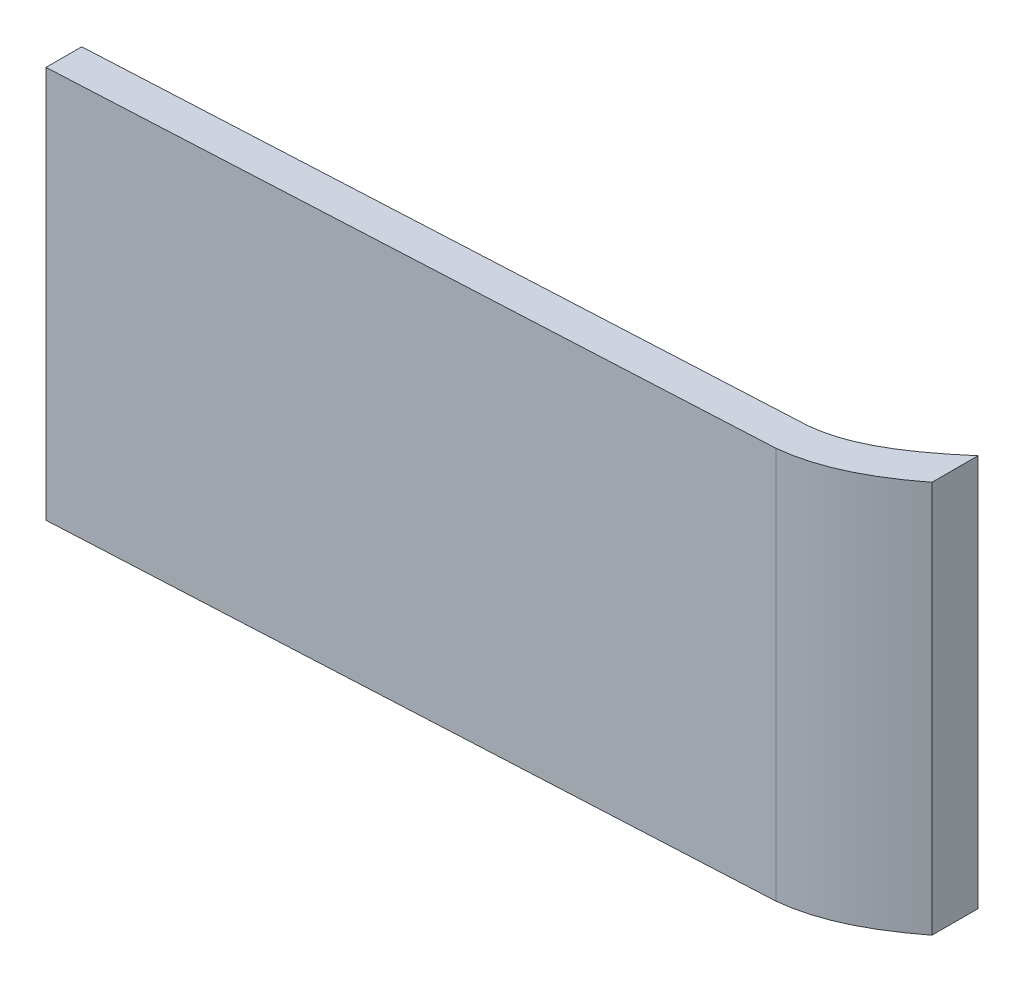
ISO-10303-21;
HEADER;
FILE_DESCRIPTION(('STEP AP214'),'2;1');
FILE_NAME('part.step','',(''),(''),'','','');
FILE_SCHEMA(('AUTOMOTIVE_DESIGN { 1 0 10303 214 1 1 1 1 }'));
ENDSEC;
DATA;
#1=APPLICATION_CONTEXT('core data for automotive mechanical design processes');
#2=APPLICATION_PROTOCOL_DEFINITION('international standard','automotive_design',2000,#1);
#3=PRODUCT_CONTEXT('',#1,'mechanical');
#4=PRODUCT('Part','Part','',(#3));
#5=PRODUCT_RELATED_PRODUCT_CATEGORY('part','',(#4));
#6=PRODUCT_DEFINITION_FORMATION('','',#4);
#7=PRODUCT_DEFINITION_CONTEXT('part definition',#1,'design');
#8=PRODUCT_DEFINITION('design','',#6,#7);
#9=PRODUCT_DEFINITION_SHAPE('','',#8);
#10=(LENGTH_UNIT() NAMED_UNIT(*) SI_UNIT(.MILLI.,.METRE.));
#11=(NAMED_UNIT(*) PLANE_ANGLE_UNIT() SI_UNIT($,.RADIAN.));
#12=(NAMED_UNIT(*) SI_UNIT($,.STERADIAN.) SOLID_ANGLE_UNIT());
#13=UNCERTAINTY_MEASURE_WITH_UNIT(LENGTH_MEASURE(1.E-05),#10,'distance_accuracy_value','');
#14=(GEOMETRIC_REPRESENTATION_CONTEXT(3) GLOBAL_UNCERTAINTY_ASSIGNED_CONTEXT((#13)) GLOBAL_UNIT_ASSIGNED_CONTEXT((#10,
#11,#12)) REPRESENTATION_CONTEXT('',''));
#15=CARTESIAN_POINT('',(0.,0.,0.));
#16=DIRECTION('',(0.,0.,1.));
#17=DIRECTION('',(1.,0.,0.));
#18=AXIS2_PLACEMENT_3D('',#15,#16,#17);
#19=CARTESIAN_POINT('',(15.2026066350711,-55.02,-53.3815975655058));
#20=DIRECTION('',(-1.,0.,0.));
#21=DIRECTION('',(0.,0.,1.));
#22=AXIS2_PLACEMENT_3D('',#19,#20,#21);
#23=PLANE('',#22);
#24=DIRECTION('',(0.,-1.,0.));
#25=VECTOR('',#24,1.);
#26=CARTESIAN_POINT('',(15.2026066350711,-55.,62.2678534896764));
#27=LINE('',#26,#25);
#28=CARTESIAN_POINT('',(15.2026066350711,0.,62.2678534896764));
#29=VERTEX_POINT('',#28);
#30=CARTESIAN_POINT('',(15.2026066350711,-55.,62.2678534896764));
#31=VERTEX_POINT('',#30);
#32=EDGE_CURVE('E329',#29,#31,#27,.T.);
#33=ORIENTED_EDGE('',*,*,#32,.F.);
#34=DIRECTION('',(0.,0.,-1.));
#35=VECTOR('',#34,1.);
#36=CARTESIAN_POINT('',(15.2026066350711,0.,32.5431279620853));
#37=LINE('',#36,#35);
#38=CARTESIAN_POINT('',(15.2026066350711,0.,57.261470947906));
#39=VERTEX_POINT('',#38);
#40=EDGE_CURVE('E322',#29,#39,#37,.T.);
#41=ORIENTED_EDGE('',*,*,#40,.T.);
#42=DIRECTION('',(0.,-1.,0.));
#43=VECTOR('',#42,1.);
#44=CARTESIAN_POINT('',(15.2026066350711,-55.,57.261470947906));
#45=LINE('',#44,#43);
#46=CARTESIAN_POINT('',(15.2026066350711,-25.,57.261470947906));
#47=VERTEX_POINT('',#46);
#48=EDGE_CURVE('E325',#39,#47,#45,.T.);
#49=ORIENTED_EDGE('',*,*,#48,.T.);
#50=DIRECTION('',(0.,0.,-1.));
#51=VECTOR('',#50,1.);
#52=CARTESIAN_POINT('',(15.2026066350711,-25.,54.7700862993215));
#53=LINE('',#52,#51);
#54=CARTESIAN_POINT('',(15.2026066350711,-25.,54.2576414228439));
#55=VERTEX_POINT('',#54);
#56=EDGE_CURVE('E141',#47,#55,#53,.T.);
#57=ORIENTED_EDGE('',*,*,#56,.T.);
#58=DIRECTION('',(0.,1.,0.));
#59=VECTOR('',#58,1.);
#60=CARTESIAN_POINT('',(15.2026066350711,0.,54.2576414228439));
#61=LINE('',#60,#59);
#62=CARTESIAN_POINT('',(15.2026066350711,-27.,54.2576414228439));
#63=VERTEX_POINT('',#62);
#64=EDGE_CURVE('E152',#63,#55,#61,.T.);
#65=ORIENTED_EDGE('',*,*,#64,.F.);
#66=DIRECTION('',(0.,0.,-1.));
#67=VECTOR('',#66,1.);
#68=CARTESIAN_POINT('',(15.2026066350711,-27.,54.7700862993215));
#69=LINE('',#68,#67);
#70=CARTESIAN_POINT('',(15.2026066350711,-27.,57.261470947906));
#71=VERTEX_POINT('',#70);
#72=EDGE_CURVE('E337',#71,#63,#69,.T.);
#73=ORIENTED_EDGE('',*,*,#72,.F.);
#74=CARTESIAN_POINT('',(15.2026066350711,-53.,57.2614709479061));
#75=VERTEX_POINT('',#74);
#76=EDGE_CURVE('E140',#71,#75,#45,.T.);
#77=ORIENTED_EDGE('',*,*,#76,.T.);
#78=DIRECTION('',(0.,0.,-1.));
#79=VECTOR('',#78,1.);
#80=CARTESIAN_POINT('',(15.2026066350711,-53.,54.7700862993215));
#81=LINE('',#80,#79);
#82=CARTESIAN_POINT('',(15.2026066350711,-53.,54.2576414228439));
#83=VERTEX_POINT('',#82);
#84=EDGE_CURVE('E130',#75,#83,#81,.T.);
#85=ORIENTED_EDGE('',*,*,#84,.T.);
#86=DIRECTION('',(0.,-1.,0.));
#87=VECTOR('',#86,1.);
#88=CARTESIAN_POINT('',(15.2026066350711,0.,54.2576414228439));
#89=LINE('',#88,#87);
#90=CARTESIAN_POINT('',(15.2026066350711,-55.,54.2576414228439));
#91=VERTEX_POINT('',#90);
#92=EDGE_CURVE('E138',#83,#91,#89,.T.);
#93=ORIENTED_EDGE('',*,*,#92,.T.);
#94=DIRECTION('',(0.,0.,-1.));
#95=VECTOR('',#94,1.);
#96=CARTESIAN_POINT('',(15.2026066350711,-55.,32.5431279620853));
#97=LINE('',#96,#95);
#98=EDGE_CURVE('E335',#31,#91,#97,.T.);
#99=ORIENTED_EDGE('',*,*,#98,.F.);
#100=EDGE_LOOP('',(#33,#41,#49,#57,#65,#73,#77,#85,#93,#99));
#101=FACE_BOUND('',#100,.T.);
#102=ADVANCED_FACE('F35',(#101),#23,.T.);
#103=CARTESIAN_POINT('',(112.637979465165,-55.,57.3431279620853));
#104=CARTESIAN_POINT('',(125.082628435847,-55.,56.0277246140255));
#105=CARTESIAN_POINT('',(133.287763268237,-55.,44.6620146683521));
#106=CARTESIAN_POINT('',(142.702606635071,-55.,37.9431279620853));
#107=B_SPLINE_CURVE_WITH_KNOTS('',3,(#103,#104,#105,#106),.UNSPECIFIED.,.F.,.F.,(4,4),(0.,1.),.UNSPECIFIED.);
#108=DIRECTION('',(0.,1.,0.));
#109=VECTOR('',#108,1.);
#110=SURFACE_OF_LINEAR_EXTRUSION('',#107,#109);
#111=DIRECTION('',(0.,1.,0.));
#112=VECTOR('',#111,1.);
#113=CARTESIAN_POINT('',(127.702606635071,-55.,50.5386095784652));
#114=LINE('',#113,#112);
#115=CARTESIAN_POINT('',(127.702606630983,0.,50.5386095816137));
#116=VERTEX_POINT('',#115);
#117=CARTESIAN_POINT('',(127.702606635071,-55.,50.5386095784652));
#118=VERTEX_POINT('',#117);
#119=EDGE_CURVE('E179',#116,#118,#114,.F.);
#120=ORIENTED_EDGE('',*,*,#119,.F.);
#121=CARTESIAN_POINT('',(112.637979465165,0.,57.3431279620853));
#122=CARTESIAN_POINT('',(125.082628435847,0.,56.0277246140255));
#123=CARTESIAN_POINT('',(133.287763268237,0.,44.6620146683521));
#124=CARTESIAN_POINT('',(142.702606635071,0.,37.9431279620853));
#125=B_SPLINE_CURVE_WITH_KNOTS('',3,(#121,#122,#123,#124),.UNSPECIFIED.,.F.,.F.,(4,4),(0.,1.),.UNSPECIFIED.);
#126=CARTESIAN_POINT('',(112.637979465165,0.,57.3431279620853));
#127=VERTEX_POINT('',#126);
#128=EDGE_CURVE('E157',#127,#116,#125,.T.);
#129=ORIENTED_EDGE('',*,*,#128,.F.);
#130=DIRECTION('',(0.,1.,0.));
#131=VECTOR('',#130,1.);
#132=CARTESIAN_POINT('',(112.637979465165,-55.,57.3431279620853));
#133=LINE('',#132,#131);
#134=CARTESIAN_POINT('',(112.637979465165,-55.,57.3431279620853));
#135=VERTEX_POINT('',#134);
#136=EDGE_CURVE('E311',#135,#127,#133,.T.);
#137=ORIENTED_EDGE('',*,*,#136,.F.);
#138=EDGE_CURVE('E161',#135,#118,#107,.T.);
#139=ORIENTED_EDGE('',*,*,#138,.T.);
#140=EDGE_LOOP('',(#120,#129,#137,#139));
#141=FACE_BOUND('',#140,.T.);
#142=ADVANCED_FACE('F227',(#141),#110,.T.);
#143=CARTESIAN_POINT('',(-77.2973933649289,-55.,66.9431279620853));
#144=DIRECTION('',(0.0504790708541747,0.,0.998725119042121));
#145=DIRECTION('',(0.998725119042121,0.,-0.0504790708541747));
#146=AXIS2_PLACEMENT_3D('',#143,#144,#145);
#147=PLANE('',#146);
#148=DIRECTION('',(0.998725119042121,0.,-0.0504790708541747));
#149=VECTOR('',#148,1.);
#150=CARTESIAN_POINT('',(-77.2973933649289,0.,66.9431279620853));
#151=LINE('',#150,#149);
#152=EDGE_CURVE('E155',#29,#127,#151,.T.);
#153=ORIENTED_EDGE('',*,*,#152,.F.);
#154=ORIENTED_EDGE('',*,*,#32,.T.);
#155=DIRECTION('',(0.998725119042121,0.,-0.0504790708541747));
#156=VECTOR('',#155,1.);
#157=CARTESIAN_POINT('',(-77.2973933649289,-55.,66.9431279620853));
#158=LINE('',#157,#156);
#159=EDGE_CURVE('E159',#31,#135,#158,.T.);
#160=ORIENTED_EDGE('',*,*,#159,.T.);
#161=ORIENTED_EDGE('',*,*,#136,.T.);
#162=EDGE_LOOP('',(#153,#154,#160,#161));
#163=FACE_BOUND('',#162,.T.);
#164=ADVANCED_FACE('F297',(#163),#147,.T.);
#165=CARTESIAN_POINT('',(-77.2198387862858,-55.,61.9328255398636));
#166=DIRECTION('',(0.0504790708541748,0.,0.998725119042121));
#167=DIRECTION('',(0.998725119042121,0.,-0.0504790708541748));
#168=AXIS2_PLACEMENT_3D('',#165,#166,#167);
#169=PLANE('',#168);
#170=ORIENTED_EDGE('',*,*,#48,.F.);
#171=DIRECTION('',(0.998725119042121,0.,-0.0504790708541748));
#172=VECTOR('',#171,1.);
#173=CARTESIAN_POINT('',(-77.2198387862858,0.,61.9328255398636));
#174=LINE('',#173,#172);
#175=CARTESIAN_POINT('',(112.240105598559,0.,52.356855361199));
#176=VERTEX_POINT('',#175);
#177=EDGE_CURVE('E154',#39,#176,#174,.T.);
#178=ORIENTED_EDGE('',*,*,#177,.T.);
#179=DIRECTION('',(0.,1.,0.));
#180=VECTOR('',#179,1.);
#181=CARTESIAN_POINT('',(112.240105598559,-55.,52.356855361199));
#182=LINE('',#181,#180);
#183=CARTESIAN_POINT('',(112.240105598559,-55.,52.356855361199));
#184=VERTEX_POINT('',#183);
#185=EDGE_CURVE('E158',#184,#176,#182,.T.);
#186=ORIENTED_EDGE('',*,*,#185,.F.);
#187=DIRECTION('',(0.998725119042121,0.,-0.0504790708541748));
#188=VECTOR('',#187,1.);
#189=CARTESIAN_POINT('',(-77.2198387862858,-55.,61.9328255398636));
#190=LINE('',#189,#188);
#191=CARTESIAN_POINT('',(25.1898578254923,-55.,56.7566802393643));
#192=VERTEX_POINT('',#191);
#193=EDGE_CURVE('E176',#192,#184,#190,.T.);
#194=ORIENTED_EDGE('',*,*,#193,.F.);
#195=DIRECTION('',(0.,-1.,0.));
#196=VECTOR('',#195,1.);
#197=CARTESIAN_POINT('',(25.1898578254923,-53.,56.7566802393643));
#198=LINE('',#197,#196);
#199=CARTESIAN_POINT('',(25.1898578254923,-53.,56.7566802393643));
#200=VERTEX_POINT('',#199);
#201=EDGE_CURVE('E171',#200,#192,#198,.T.);
#202=ORIENTED_EDGE('',*,*,#201,.F.);
#203=DIRECTION('',(0.998725119042121,0.,-0.0504790708541747));
#204=VECTOR('',#203,1.);
#205=CARTESIAN_POINT('',(5.21535544464991,-53.,57.7662616564478));
#206=LINE('',#205,#204);
#207=EDGE_CURVE('E169',#75,#200,#206,.T.);
#208=ORIENTED_EDGE('',*,*,#207,.F.);
#209=ORIENTED_EDGE('',*,*,#76,.F.);
#210=DIRECTION('',(0.998725119042121,0.,-0.0504790708541748));
#211=VECTOR('',#210,1.);
#212=CARTESIAN_POINT('',(-77.2198387862858,-27.,61.9328255398636));
#213=LINE('',#212,#211);
#214=CARTESIAN_POINT('',(25.1898578254923,-27.,56.7566802393643));
#215=VERTEX_POINT('',#214);
#216=EDGE_CURVE('E151',#71,#215,#213,.T.);
#217=ORIENTED_EDGE('',*,*,#216,.T.);
#218=DIRECTION('',(0.,1.,0.));
#219=VECTOR('',#218,1.);
#220=CARTESIAN_POINT('',(25.1898578254923,-27.,56.7566802393643));
#221=LINE('',#220,#219);
#222=CARTESIAN_POINT('',(25.1898578254923,-25.,56.7566802393643));
#223=VERTEX_POINT('',#222);
#224=EDGE_CURVE('E168',#215,#223,#221,.T.);
#225=ORIENTED_EDGE('',*,*,#224,.T.);
#226=DIRECTION('',(0.998725119042121,0.,-0.0504790708541748));
#227=VECTOR('',#226,1.);
#228=CARTESIAN_POINT('',(-77.2198387862858,-25.,61.9328255398636));
#229=LINE('',#228,#227);
#230=EDGE_CURVE('E149',#47,#223,#229,.T.);
#231=ORIENTED_EDGE('',*,*,#230,.F.);
#232=EDGE_LOOP('',(#170,#178,#186,#194,#202,#208,#209,#217,#225,#231));
#233=FACE_BOUND('',#232,.T.);
#234=ADVANCED_FACE('F275',(#233),#169,.F.);
#235=CARTESIAN_POINT('',(-115.897393364929,-55.,32.5431279620853));
#236=DIRECTION('',(0.,-1.,0.));
#237=DIRECTION('',(0.,0.,-1.));
#238=AXIS2_PLACEMENT_3D('',#235,#236,#237);
#239=PLANE('',#238);
#240=ORIENTED_EDGE('',*,*,#159,.F.);
#241=ORIENTED_EDGE('',*,*,#98,.T.);
#242=DIRECTION('',(0.998725119042121,0.,-0.0504790708541747));
#243=VECTOR('',#242,1.);
#244=CARTESIAN_POINT('',(5.06391823208739,-55.,54.7700862993215));
#245=LINE('',#244,#243);
#246=CARTESIAN_POINT('',(25.0384206129298,-55.,53.760504882238));
#247=VERTEX_POINT('',#246);
#248=EDGE_CURVE('E144',#91,#247,#245,.T.);
#249=ORIENTED_EDGE('',*,*,#248,.T.);
#250=DIRECTION('',(0.0504790708541748,0.,0.998725119042121));
#251=VECTOR('',#250,1.);
#252=CARTESIAN_POINT('',(25.0384206129298,-55.,53.760504882238));
#253=LINE('',#252,#251);
#254=EDGE_CURVE('E45',#247,#192,#253,.T.);
#255=ORIENTED_EDGE('',*,*,#254,.T.);
#256=ORIENTED_EDGE('',*,*,#193,.T.);
#257=CARTESIAN_POINT('',(127.702606635083,-55.,44.0854997038493));
#258=CARTESIAN_POINT('',(127.648334728722,-55.,44.1319265625261));
#259=CARTESIAN_POINT('',(127.594021710344,-55.,44.1783019917653));
#260=CARTESIAN_POINT('',(126.421126605525,-55.,45.177833585712));
#261=CARTESIAN_POINT('',(125.285242411055,-55.,46.1072897473864));
#262=CARTESIAN_POINT('',(122.940710015654,-55.,47.8665531930068));
#263=CARTESIAN_POINT('',(121.732436004902,-55.,48.6968729230532));
#264=CARTESIAN_POINT('',(119.826422425126,-55.,49.8141656456051));
#265=CARTESIAN_POINT('',(119.174145436909,-55.,50.1652416105287));
#266=CARTESIAN_POINT('',(117.853343767534,-55.,50.8014316555564));
#267=CARTESIAN_POINT('',(117.182437856964,-55.,51.0880355779591));
#268=CARTESIAN_POINT('',(115.132971642683,-55.,51.8376862995458));
#269=CARTESIAN_POINT('',(113.717382254336,-55.,52.189730891389));
#270=CARTESIAN_POINT('',(112.240105598559,-55.,52.356855361199));
#271=B_SPLINE_CURVE_WITH_KNOTS('',3,(#257,#258,#259,#260,#261,#262,#263,#264,#265,#266,#267,
#268,#269,#270),.UNSPECIFIED.,.F.,.F.,(4,2,2,2,2,2,4),(0.,0.00607443775296701,0.131074437752967,
0.256074437752967,0.318574437752967,0.381074437752967,0.506074437752967),.UNSPECIFIED.);
#272=CARTESIAN_POINT('',(127.702606635083,-55.,44.0854997038494));
#273=VERTEX_POINT('',#272);
#274=EDGE_CURVE('E178',#184,#273,#271,.F.);
#275=ORIENTED_EDGE('',*,*,#274,.T.);
#276=DIRECTION('',(0.,0.,-1.));
#277=VECTOR('',#276,1.);
#278=CARTESIAN_POINT('',(127.702606635071,-55.,32.5431279620852));
#279=LINE('',#278,#277);
#280=EDGE_CURVE('E182',#118,#273,#279,.T.);
#281=ORIENTED_EDGE('',*,*,#280,.F.);
#282=ORIENTED_EDGE('',*,*,#138,.F.);
#283=EDGE_LOOP('',(#240,#241,#249,#255,#256,#275,#281,#282));
#284=FACE_BOUND('',#283,.T.);
#285=ADVANCED_FACE('F252',(#284),#239,.T.);
#286=CARTESIAN_POINT('',(25.0384206129298,-53.,53.760504882238));
#287=DIRECTION('',(-0.998725119042121,0.,0.0504790708541748));
#288=DIRECTION('',(0.0504790708541748,0.,0.998725119042121));
#289=AXIS2_PLACEMENT_3D('',#286,#287,#288);
#290=PLANE('',#289);
#291=ORIENTED_EDGE('',*,*,#201,.T.);
#292=ORIENTED_EDGE('',*,*,#254,.F.);
#293=DIRECTION('',(0.,-1.,0.));
#294=VECTOR('',#293,1.);
#295=CARTESIAN_POINT('',(25.0384206129298,-53.,53.760504882238));
#296=LINE('',#295,#294);
#297=CARTESIAN_POINT('',(25.0384206129298,-53.,53.760504882238));
#298=VERTEX_POINT('',#297);
#299=EDGE_CURVE('E132',#298,#247,#296,.T.);
#300=ORIENTED_EDGE('',*,*,#299,.F.);
#301=DIRECTION('',(0.0504790708541748,0.,0.998725119042121));
#302=VECTOR('',#301,1.);
#303=CARTESIAN_POINT('',(25.0384206129298,-53.,53.760504882238));
#304=LINE('',#303,#302);
#305=EDGE_CURVE('E11',#298,#200,#304,.T.);
#306=ORIENTED_EDGE('',*,*,#305,.T.);
#307=EDGE_LOOP('',(#291,#292,#300,#306));
#308=FACE_BOUND('',#307,.T.);
#309=ADVANCED_FACE('F274',(#308),#290,.F.);
#310=CARTESIAN_POINT('',(5.06391823208739,-53.,54.7700862993215));
#311=DIRECTION('',(0.,-1.,0.));
#312=DIRECTION('',(0.,0.,-1.));
#313=AXIS2_PLACEMENT_3D('',#310,#311,#312);
#314=PLANE('',#313);
#315=ORIENTED_EDGE('',*,*,#84,.F.);
#316=ORIENTED_EDGE('',*,*,#207,.T.);
#317=ORIENTED_EDGE('',*,*,#305,.F.);
#318=DIRECTION('',(0.998725119042121,0.,-0.0504790708541747));
#319=VECTOR('',#318,1.);
#320=CARTESIAN_POINT('',(5.06391823208739,-53.,54.7700862993215));
#321=LINE('',#320,#319);
#322=EDGE_CURVE('E53',#83,#298,#321,.T.);
#323=ORIENTED_EDGE('',*,*,#322,.F.);
#324=EDGE_LOOP('',(#315,#316,#317,#323));
#325=FACE_BOUND('',#324,.T.);
#326=ADVANCED_FACE('F128',(#325),#314,.F.);
#327=CARTESIAN_POINT('',(2.77412190406091,0.,54.88582063791));
#328=DIRECTION('',(0.0504790708541748,0.,0.998725119042121));
#329=DIRECTION('',(0.998725119042121,0.,-0.0504790708541748));
#330=AXIS2_PLACEMENT_3D('',#327,#328,#329);
#331=PLANE('',#330);
#332=ORIENTED_EDGE('',*,*,#92,.F.);
#333=ORIENTED_EDGE('',*,*,#322,.T.);
#334=ORIENTED_EDGE('',*,*,#299,.T.);
#335=ORIENTED_EDGE('',*,*,#248,.F.);
#336=EDGE_LOOP('',(#332,#333,#334,#335));
#337=FACE_BOUND('',#336,.T.);
#338=ADVANCED_FACE('F143',(#337),#331,.F.);
#339=CARTESIAN_POINT('',(25.0384206129298,-27.,53.760504882238));
#340=DIRECTION('',(0.998725119042121,0.,-0.0504790708541748));
#341=DIRECTION('',(-0.0504790708541748,0.,-0.998725119042121));
#342=AXIS2_PLACEMENT_3D('',#339,#340,#341);
#343=PLANE('',#342);
#344=ORIENTED_EDGE('',*,*,#224,.F.);
#345=DIRECTION('',(0.0504790708541748,0.,0.998725119042121));
#346=VECTOR('',#345,1.);
#347=CARTESIAN_POINT('',(25.0384206129298,-27.,53.760504882238));
#348=LINE('',#347,#346);
#349=CARTESIAN_POINT('',(25.0384206129298,-27.,53.760504882238));
#350=VERTEX_POINT('',#349);
#351=EDGE_CURVE('E165',#350,#215,#348,.T.);
#352=ORIENTED_EDGE('',*,*,#351,.F.);
#353=DIRECTION('',(0.,1.,0.));
#354=VECTOR('',#353,1.);
#355=CARTESIAN_POINT('',(25.0384206129298,-27.,53.760504882238));
#356=LINE('',#355,#354);
#357=CARTESIAN_POINT('',(25.0384206129298,-25.,53.760504882238));
#358=VERTEX_POINT('',#357);
#359=EDGE_CURVE('E164',#350,#358,#356,.T.);
#360=ORIENTED_EDGE('',*,*,#359,.T.);
#361=DIRECTION('',(0.0504790708541748,0.,0.998725119042121));
#362=VECTOR('',#361,1.);
#363=CARTESIAN_POINT('',(25.0384206129298,-25.,53.760504882238));
#364=LINE('',#363,#362);
#365=EDGE_CURVE('E195',#358,#223,#364,.T.);
#366=ORIENTED_EDGE('',*,*,#365,.T.);
#367=EDGE_LOOP('',(#344,#352,#360,#366));
#368=FACE_BOUND('',#367,.T.);
#369=ADVANCED_FACE('F280',(#368),#343,.T.);
#370=CARTESIAN_POINT('',(5.06391823208738,-25.,54.7700862993215));
#371=DIRECTION('',(0.,-1.,0.));
#372=DIRECTION('',(0.,0.,-1.));
#373=AXIS2_PLACEMENT_3D('',#370,#371,#372);
#374=PLANE('',#373);
#375=ORIENTED_EDGE('',*,*,#56,.F.);
#376=ORIENTED_EDGE('',*,*,#230,.T.);
#377=ORIENTED_EDGE('',*,*,#365,.F.);
#378=DIRECTION('',(0.998725119042121,0.,-0.0504790708541747));
#379=VECTOR('',#378,1.);
#380=CARTESIAN_POINT('',(5.06391823208738,-25.,54.7700862993215));
#381=LINE('',#380,#379);
#382=EDGE_CURVE('E166',#55,#358,#381,.T.);
#383=ORIENTED_EDGE('',*,*,#382,.F.);
#384=EDGE_LOOP('',(#375,#376,#377,#383));
#385=FACE_BOUND('',#384,.T.);
#386=ADVANCED_FACE('F285',(#385),#374,.F.);
#387=CARTESIAN_POINT('',(5.06391823208739,-27.,54.7700862993215));
#388=DIRECTION('',(0.,-1.,0.));
#389=DIRECTION('',(0.,0.,-1.));
#390=AXIS2_PLACEMENT_3D('',#387,#388,#389);
#391=PLANE('',#390);
#392=ORIENTED_EDGE('',*,*,#216,.F.);
#393=ORIENTED_EDGE('',*,*,#72,.T.);
#394=DIRECTION('',(0.998725119042121,0.,-0.0504790708541747));
#395=VECTOR('',#394,1.);
#396=CARTESIAN_POINT('',(5.06391823208739,-27.,54.7700862993215));
#397=LINE('',#396,#395);
#398=EDGE_CURVE('E162',#63,#350,#397,.T.);
#399=ORIENTED_EDGE('',*,*,#398,.T.);
#400=ORIENTED_EDGE('',*,*,#351,.T.);
#401=EDGE_LOOP('',(#392,#393,#399,#400));
#402=FACE_BOUND('',#401,.T.);
#403=ADVANCED_FACE('F287',(#402),#391,.T.);
#404=CARTESIAN_POINT('',(2.7741219040609,0.,54.88582063791));
#405=DIRECTION('',(-0.0504790708541747,0.,-0.998725119042121));
#406=DIRECTION('',(-0.998725119042121,0.,0.0504790708541747));
#407=AXIS2_PLACEMENT_3D('',#404,#405,#406);
#408=PLANE('',#407);
#409=ORIENTED_EDGE('',*,*,#398,.F.);
#410=ORIENTED_EDGE('',*,*,#64,.T.);
#411=ORIENTED_EDGE('',*,*,#382,.T.);
#412=ORIENTED_EDGE('',*,*,#359,.F.);
#413=EDGE_LOOP('',(#409,#410,#411,#412));
#414=FACE_BOUND('',#413,.T.);
#415=ADVANCED_FACE('F37',(#414),#408,.T.);
#416=CARTESIAN_POINT('',(-115.897393364929,0.,32.5431279620853));
#417=DIRECTION('',(0.,-1.,0.));
#418=DIRECTION('',(0.,0.,-1.));
#419=AXIS2_PLACEMENT_3D('',#416,#417,#418);
#420=PLANE('',#419);
#421=ORIENTED_EDGE('',*,*,#40,.F.);
#422=ORIENTED_EDGE('',*,*,#152,.T.);
#423=ORIENTED_EDGE('',*,*,#128,.T.);
#424=DIRECTION('',(0.,0.,-1.));
#425=VECTOR('',#424,1.);
#426=CARTESIAN_POINT('',(127.702606635071,0.,32.5431279620852));
#427=LINE('',#426,#425);
#428=CARTESIAN_POINT('',(127.702606635083,0.,44.0854997038494));
#429=VERTEX_POINT('',#428);
#430=EDGE_CURVE('E191',#116,#429,#427,.T.);
#431=ORIENTED_EDGE('',*,*,#430,.T.);
#432=CARTESIAN_POINT('',(112.240105598559,0.,52.356855361199));
#433=CARTESIAN_POINT('',(113.717382254336,0.,52.189730891389));
#434=CARTESIAN_POINT('',(115.132971642683,0.,51.8376862995458));
#435=CARTESIAN_POINT('',(117.182437856964,0.,51.0880355779591));
#436=CARTESIAN_POINT('',(117.853343767534,0.,50.8014316555564));
#437=CARTESIAN_POINT('',(119.174145436909,0.,50.1652416105287));
#438=CARTESIAN_POINT('',(119.826422425126,0.,49.8141656456051));
#439=CARTESIAN_POINT('',(121.732436004902,0.,48.6968729230532));
#440=CARTESIAN_POINT('',(122.940710015654,0.,47.8665531930068));
#441=CARTESIAN_POINT('',(125.285242411055,0.,46.1072897473864));
#442=CARTESIAN_POINT('',(126.421126605525,0.,45.177833585712));
#443=CARTESIAN_POINT('',(127.594021710344,0.,44.1783019917653));
#444=CARTESIAN_POINT('',(127.648334728722,0.,44.1319265625261));
#445=CARTESIAN_POINT('',(127.702606635083,0.,44.0854997038493));
#446=B_SPLINE_CURVE_WITH_KNOTS('',3,(#432,#433,#434,#435,#436,#437,#438,#439,#440,#441,#442,
#443,#444,#445),.UNSPECIFIED.,.F.,.F.,(4,2,2,2,2,2,4),(0.,0.125,0.1875,0.25,0.375,0.5,
0.506074437752967),.UNSPECIFIED.);
#447=EDGE_CURVE('E175',#176,#429,#446,.T.);
#448=ORIENTED_EDGE('',*,*,#447,.F.);
#449=ORIENTED_EDGE('',*,*,#177,.F.);
#450=EDGE_LOOP('',(#421,#422,#423,#431,#448,#449));
#451=FACE_BOUND('',#450,.T.);
#452=ADVANCED_FACE('F226',(#451),#420,.F.);
#453=CARTESIAN_POINT('',(112.240105598559,-55.,52.356855361199));
#454=CARTESIAN_POINT('',(113.717382254336,-55.,52.189730891389));
#455=CARTESIAN_POINT('',(115.132971642683,-55.,51.8376862995458));
#456=CARTESIAN_POINT('',(117.182437856964,-55.,51.0880355779591));
#457=CARTESIAN_POINT('',(117.853343767534,-55.,50.8014316555564));
#458=CARTESIAN_POINT('',(119.174145436909,-55.,50.1652416105287));
#459=CARTESIAN_POINT('',(119.826422425126,-55.,49.8141656456051));
#460=CARTESIAN_POINT('',(121.732436004902,-55.,48.6968729230532));
#461=CARTESIAN_POINT('',(122.940710015654,-55.,47.8665531930068));
#462=CARTESIAN_POINT('',(125.285242411055,-55.,46.1072897473864));
#463=CARTESIAN_POINT('',(126.421126605525,-55.,45.177833585712));
#464=CARTESIAN_POINT('',(129.776744007721,-55.,42.3182039420095));
#465=CARTESIAN_POINT('',(131.941068585836,-55.,40.3207979290708));
#466=CARTESIAN_POINT('',(135.270864820363,-55.,37.4273626816969));
#467=CARTESIAN_POINT('',(136.394500227286,-55.,36.4793796421432));
#468=CARTESIAN_POINT('',(138.125246964345,-55.,35.1119272669463));
#469=CARTESIAN_POINT('',(138.709731417625,-55.,34.6652208377664));
#470=CARTESIAN_POINT('',(139.60119430762,-55.,34.0128999007013));
#471=CARTESIAN_POINT('',(139.901611466596,-55.,33.7993872574852));
#472=CARTESIAN_POINT('',(140.501528350152,-55.,33.3712576097852));
#473=CARTESIAN_POINT('',(140.80148679193,-55.,33.1571927859353));
#474=CARTESIAN_POINT('',(141.101445233709,-55.,32.9431279620853));
#475=B_SPLINE_CURVE_WITH_KNOTS('',3,(#453,#454,#455,#456,#457,#458,#459,#460,#461,#462,#463,
#464,#465,#466,#467,#468,#469,#470,#471,#472,#473,#474),.UNSPECIFIED.,.F.,.F.,(4,2,2,2,2,2,2,2,
2,2,4),(0.,0.125,0.1875,0.25,0.375,0.5,0.75,0.875000000000001,0.937500000000001,
0.968750000000001,1.),.UNSPECIFIED.);
#476=DIRECTION('',(0.,1.,0.));
#477=VECTOR('',#476,1.);
#478=SURFACE_OF_LINEAR_EXTRUSION('',#475,#477);
#479=ORIENTED_EDGE('',*,*,#447,.T.);
#480=DIRECTION('',(0.,1.,0.));
#481=VECTOR('',#480,1.);
#482=CARTESIAN_POINT('',(127.702606635083,-55.,44.0854997038494));
#483=LINE('',#482,#481);
#484=EDGE_CURVE('E181',#273,#429,#483,.T.);
#485=ORIENTED_EDGE('',*,*,#484,.F.);
#486=ORIENTED_EDGE('',*,*,#274,.F.);
#487=ORIENTED_EDGE('',*,*,#185,.T.);
#488=EDGE_LOOP('',(#479,#485,#486,#487));
#489=FACE_BOUND('',#488,.T.);
#490=ADVANCED_FACE('F215',(#489),#478,.F.);
#491=CARTESIAN_POINT('',(127.702606635071,-55.02,-41.6523536542946));
#492=DIRECTION('',(-1.,0.,0.));
#493=DIRECTION('',(0.,0.,1.));
#494=AXIS2_PLACEMENT_3D('',#491,#492,#493);
#495=PLANE('',#494);
#496=ORIENTED_EDGE('',*,*,#280,.T.);
#497=ORIENTED_EDGE('',*,*,#484,.T.);
#498=ORIENTED_EDGE('',*,*,#430,.F.);
#499=ORIENTED_EDGE('',*,*,#119,.T.);
#500=EDGE_LOOP('',(#496,#497,#498,#499));
#501=FACE_BOUND('',#500,.T.);
#502=ADVANCED_FACE('F225',(#501),#495,.F.);
#503=CLOSED_SHELL('',(#102,#142,#164,#234,#285,#309,#326,#338,#369,#386,#403,#415,#452,#490,#502));
#504=MANIFOLD_SOLID_BREP('B2',#503);
#505=ADVANCED_BREP_SHAPE_REPRESENTATION('',(#18,#504),#14);
#506=SHAPE_DEFINITION_REPRESENTATION(#9,#505);
ENDSEC;
END-ISO-10303-21;
